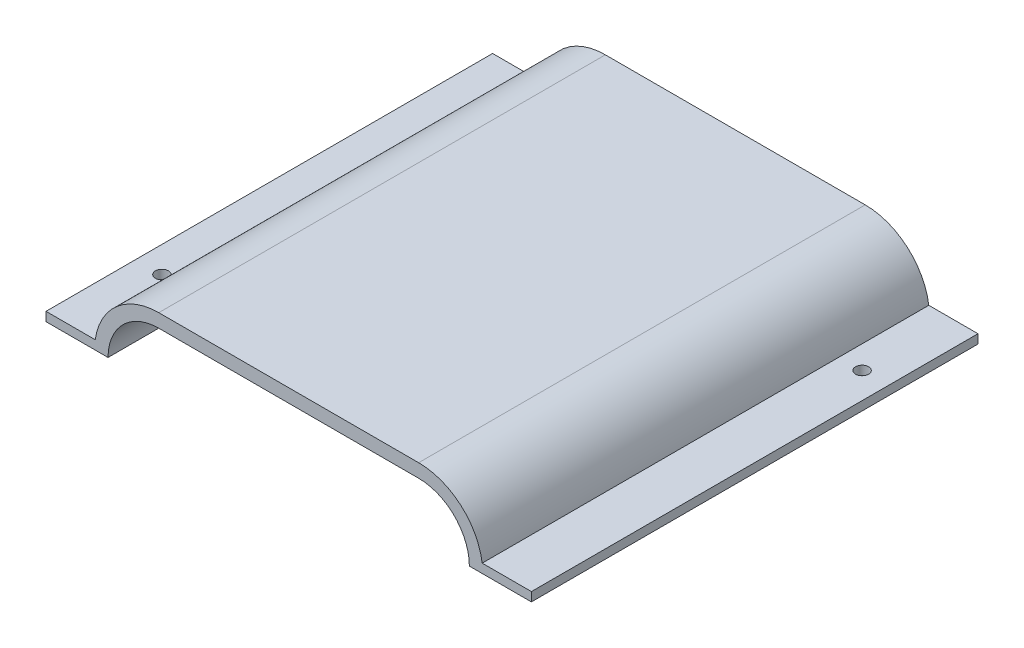
ISO-10303-21;
HEADER;
FILE_DESCRIPTION(('STEP AP214'),'2;1');
FILE_NAME('part.step','',(''),(''),'','','');
FILE_SCHEMA(('AUTOMOTIVE_DESIGN { 1 0 10303 214 1 1 1 1 }'));
ENDSEC;
DATA;
#1=APPLICATION_CONTEXT('core data for automotive mechanical design processes');
#2=APPLICATION_PROTOCOL_DEFINITION('international standard','automotive_design',2000,#1);
#3=PRODUCT_CONTEXT('',#1,'mechanical');
#4=PRODUCT('Part','Part','',(#3));
#5=PRODUCT_RELATED_PRODUCT_CATEGORY('part','',(#4));
#6=PRODUCT_DEFINITION_FORMATION('','',#4);
#7=PRODUCT_DEFINITION_CONTEXT('part definition',#1,'design');
#8=PRODUCT_DEFINITION('design','',#6,#7);
#9=PRODUCT_DEFINITION_SHAPE('','',#8);
#10=(LENGTH_UNIT() NAMED_UNIT(*) SI_UNIT(.MILLI.,.METRE.));
#11=(NAMED_UNIT(*) PLANE_ANGLE_UNIT() SI_UNIT($,.RADIAN.));
#12=(NAMED_UNIT(*) SI_UNIT($,.STERADIAN.) SOLID_ANGLE_UNIT());
#13=UNCERTAINTY_MEASURE_WITH_UNIT(LENGTH_MEASURE(1.E-05),#10,'distance_accuracy_value','');
#14=(GEOMETRIC_REPRESENTATION_CONTEXT(3) GLOBAL_UNCERTAINTY_ASSIGNED_CONTEXT((#13)) GLOBAL_UNIT_ASSIGNED_CONTEXT((#10,
#11,#12)) REPRESENTATION_CONTEXT('',''));
#15=CARTESIAN_POINT('',(0.,0.,0.));
#16=DIRECTION('',(0.,0.,1.));
#17=DIRECTION('',(1.,0.,0.));
#18=AXIS2_PLACEMENT_3D('',#15,#16,#17);
#19=CARTESIAN_POINT('',(0.,33.35,99.5));
#20=DIRECTION('',(0.,1.,0.));
#21=DIRECTION('',(0.,0.,1.));
#22=AXIS2_PLACEMENT_3D('',#19,#20,#21);
#23=PLANE('',#22);
#24=DIRECTION('',(1.,0.,0.));
#25=VECTOR('',#24,1.);
#26=CARTESIAN_POINT('',(0.,33.35,0.));
#27=LINE('',#26,#25);
#28=CARTESIAN_POINT('',(-28.95,33.35,0.));
#29=VERTEX_POINT('',#28);
#30=CARTESIAN_POINT('',(28.95,33.35,0.));
#31=VERTEX_POINT('',#30);
#32=EDGE_CURVE('E156',#29,#31,#27,.T.);
#33=ORIENTED_EDGE('',*,*,#32,.F.);
#34=DIRECTION('',(0.,0.,-1.));
#35=VECTOR('',#34,1.);
#36=CARTESIAN_POINT('',(-28.95,33.35,99.5));
#37=LINE('',#36,#35);
#38=CARTESIAN_POINT('',(-28.95,33.35,99.5));
#39=VERTEX_POINT('',#38);
#40=EDGE_CURVE('E11',#39,#29,#37,.T.);
#41=ORIENTED_EDGE('',*,*,#40,.F.);
#42=DIRECTION('',(1.,0.,0.));
#43=VECTOR('',#42,1.);
#44=CARTESIAN_POINT('',(0.,33.35,99.5));
#45=LINE('',#44,#43);
#46=CARTESIAN_POINT('',(28.95,33.35,99.5));
#47=VERTEX_POINT('',#46);
#48=EDGE_CURVE('E187',#39,#47,#45,.T.);
#49=ORIENTED_EDGE('',*,*,#48,.T.);
#50=DIRECTION('',(0.,0.,-1.));
#51=VECTOR('',#50,1.);
#52=CARTESIAN_POINT('',(28.95,33.35,99.5));
#53=LINE('',#52,#51);
#54=EDGE_CURVE('E101',#47,#31,#53,.T.);
#55=ORIENTED_EDGE('',*,*,#54,.T.);
#56=EDGE_LOOP('',(#33,#41,#49,#55));
#57=FACE_BOUND('',#56,.T.);
#58=ADVANCED_FACE('F38',(#57),#23,.T.);
#59=CARTESIAN_POINT('',(-28.95,19.05,99.5));
#60=DIRECTION('',(0.,0.,-1.));
#61=DIRECTION('',(-1.,0.,0.));
#62=AXIS2_PLACEMENT_3D('',#59,#60,#61);
#63=CYLINDRICAL_SURFACE('',#62,14.3);
#64=CARTESIAN_POINT('',(-28.95,19.05,0.));
#65=DIRECTION('',(0.,0.,1.));
#66=DIRECTION('',(1.,0.,0.));
#67=AXIS2_PLACEMENT_3D('',#64,#65,#66);
#68=CIRCLE('',#67,14.3);
#69=CARTESIAN_POINT('',(-43.1094491418275,21.05,0.));
#70=VERTEX_POINT('',#69);
#71=EDGE_CURVE('E159',#29,#70,#68,.T.);
#72=ORIENTED_EDGE('',*,*,#71,.T.);
#73=DIRECTION('',(0.,0.,-1.));
#74=VECTOR('',#73,1.);
#75=CARTESIAN_POINT('',(-43.1094491418275,21.05,99.5));
#76=LINE('',#75,#74);
#77=CARTESIAN_POINT('',(-43.1094491418275,21.05,99.5));
#78=VERTEX_POINT('',#77);
#79=EDGE_CURVE('E46',#78,#70,#76,.T.);
#80=ORIENTED_EDGE('',*,*,#79,.F.);
#81=CARTESIAN_POINT('',(-28.95,19.05,99.5));
#82=DIRECTION('',(0.,0.,1.));
#83=DIRECTION('',(1.,0.,0.));
#84=AXIS2_PLACEMENT_3D('',#81,#82,#83);
#85=CIRCLE('',#84,14.3);
#86=EDGE_CURVE('E222',#39,#78,#85,.T.);
#87=ORIENTED_EDGE('',*,*,#86,.F.);
#88=ORIENTED_EDGE('',*,*,#40,.T.);
#89=EDGE_LOOP('',(#72,#80,#87,#88));
#90=FACE_BOUND('',#89,.T.);
#91=ADVANCED_FACE('F211',(#90),#63,.T.);
#92=CARTESIAN_POINT('',(0.,21.05,99.5));
#93=DIRECTION('',(0.,1.,0.));
#94=DIRECTION('',(-1.,0.,0.));
#95=AXIS2_PLACEMENT_3D('',#92,#93,#94);
#96=PLANE('',#95);
#97=CARTESIAN_POINT('',(-48.25,21.05,79.5));
#98=DIRECTION('',(0.,1.,0.));
#99=DIRECTION('',(-1.,0.,0.));
#100=AXIS2_PLACEMENT_3D('',#97,#98,#99);
#101=CIRCLE('',#100,1.45);
#102=CARTESIAN_POINT('',(-49.7,21.05,79.5));
#103=VERTEX_POINT('',#102);
#104=EDGE_CURVE('E272',#103,#103,#101,.F.);
#105=ORIENTED_EDGE('',*,*,#104,.T.);
#106=EDGE_LOOP('',(#105));
#107=FACE_BOUND('',#106,.T.);
#108=DIRECTION('',(1.,0.,0.));
#109=VECTOR('',#108,1.);
#110=CARTESIAN_POINT('',(0.,21.05,0.));
#111=LINE('',#110,#109);
#112=CARTESIAN_POINT('',(-54.0716006042296,21.05,0.));
#113=VERTEX_POINT('',#112);
#114=EDGE_CURVE('E163',#113,#70,#111,.T.);
#115=ORIENTED_EDGE('',*,*,#114,.F.);
#116=DIRECTION('',(0.,0.,-1.));
#117=VECTOR('',#116,1.);
#118=CARTESIAN_POINT('',(-54.0716006042296,21.05,99.5));
#119=LINE('',#118,#117);
#120=CARTESIAN_POINT('',(-54.0716006042296,21.05,99.5));
#121=VERTEX_POINT('',#120);
#122=EDGE_CURVE('E201',#121,#113,#119,.T.);
#123=ORIENTED_EDGE('',*,*,#122,.F.);
#124=DIRECTION('',(1.,0.,0.));
#125=VECTOR('',#124,1.);
#126=CARTESIAN_POINT('',(0.,21.05,99.5));
#127=LINE('',#126,#125);
#128=EDGE_CURVE('E208',#121,#78,#127,.T.);
#129=ORIENTED_EDGE('',*,*,#128,.T.);
#130=ORIENTED_EDGE('',*,*,#79,.T.);
#131=EDGE_LOOP('',(#115,#123,#129,#130));
#132=FACE_BOUND('',#131,.T.);
#133=ADVANCED_FACE('F206',(#107,#132),#96,.T.);
#134=CARTESIAN_POINT('',(-54.0716006042296,0.,99.5));
#135=DIRECTION('',(-1.,0.,0.));
#136=DIRECTION('',(0.,0.,1.));
#137=AXIS2_PLACEMENT_3D('',#134,#135,#136);
#138=PLANE('',#137);
#139=DIRECTION('',(0.,1.,0.));
#140=VECTOR('',#139,1.);
#141=CARTESIAN_POINT('',(-54.0716006042296,0.,0.));
#142=LINE('',#141,#140);
#143=CARTESIAN_POINT('',(-54.0716006042296,19.05,0.));
#144=VERTEX_POINT('',#143);
#145=EDGE_CURVE('E166',#144,#113,#142,.T.);
#146=ORIENTED_EDGE('',*,*,#145,.F.);
#147=DIRECTION('',(0.,0.,-1.));
#148=VECTOR('',#147,1.);
#149=CARTESIAN_POINT('',(-54.0716006042296,19.05,99.5));
#150=LINE('',#149,#148);
#151=CARTESIAN_POINT('',(-54.0716006042296,19.05,99.5));
#152=VERTEX_POINT('',#151);
#153=EDGE_CURVE('E199',#152,#144,#150,.T.);
#154=ORIENTED_EDGE('',*,*,#153,.F.);
#155=DIRECTION('',(0.,1.,0.));
#156=VECTOR('',#155,1.);
#157=CARTESIAN_POINT('',(-54.0716006042296,0.,99.5));
#158=LINE('',#157,#156);
#159=EDGE_CURVE('E221',#152,#121,#158,.T.);
#160=ORIENTED_EDGE('',*,*,#159,.T.);
#161=ORIENTED_EDGE('',*,*,#122,.T.);
#162=EDGE_LOOP('',(#146,#154,#160,#161));
#163=FACE_BOUND('',#162,.T.);
#164=ADVANCED_FACE('F217',(#163),#138,.T.);
#165=CARTESIAN_POINT('',(0.,19.05,99.5));
#166=DIRECTION('',(0.,1.,0.));
#167=DIRECTION('',(0.,0.,1.));
#168=AXIS2_PLACEMENT_3D('',#165,#166,#167);
#169=PLANE('',#168);
#170=CARTESIAN_POINT('',(-48.25,19.05,79.5));
#171=DIRECTION('',(0.,-1.,0.));
#172=DIRECTION('',(0.,0.,-1.));
#173=AXIS2_PLACEMENT_3D('',#170,#171,#172);
#174=CIRCLE('',#173,1.45);
#175=CARTESIAN_POINT('',(-48.25,19.05,78.05));
#176=VERTEX_POINT('',#175);
#177=EDGE_CURVE('E268',#176,#176,#174,.T.);
#178=ORIENTED_EDGE('',*,*,#177,.F.);
#179=EDGE_LOOP('',(#178));
#180=FACE_BOUND('',#179,.T.);
#181=DIRECTION('',(1.,0.,0.));
#182=VECTOR('',#181,1.);
#183=CARTESIAN_POINT('',(0.,19.05,0.));
#184=LINE('',#183,#182);
#185=CARTESIAN_POINT('',(-40.25,19.05,0.));
#186=VERTEX_POINT('',#185);
#187=EDGE_CURVE('E169',#144,#186,#184,.T.);
#188=ORIENTED_EDGE('',*,*,#187,.T.);
#189=DIRECTION('',(0.,0.,-1.));
#190=VECTOR('',#189,1.);
#191=CARTESIAN_POINT('',(-40.25,19.05,99.5));
#192=LINE('',#191,#190);
#193=CARTESIAN_POINT('',(-40.25,19.05,99.5));
#194=VERTEX_POINT('',#193);
#195=EDGE_CURVE('E197',#194,#186,#192,.T.);
#196=ORIENTED_EDGE('',*,*,#195,.F.);
#197=DIRECTION('',(1.,0.,0.));
#198=VECTOR('',#197,1.);
#199=CARTESIAN_POINT('',(0.,19.05,99.5));
#200=LINE('',#199,#198);
#201=EDGE_CURVE('E224',#152,#194,#200,.T.);
#202=ORIENTED_EDGE('',*,*,#201,.F.);
#203=ORIENTED_EDGE('',*,*,#153,.T.);
#204=EDGE_LOOP('',(#188,#196,#202,#203));
#205=FACE_BOUND('',#204,.T.);
#206=ADVANCED_FACE('F310',(#180,#205),#169,.F.);
#207=CARTESIAN_POINT('',(-28.95,19.05,99.5));
#208=DIRECTION('',(0.,0.,-1.));
#209=DIRECTION('',(-1.,0.,0.));
#210=AXIS2_PLACEMENT_3D('',#207,#208,#209);
#211=CYLINDRICAL_SURFACE('',#210,11.3);
#212=CARTESIAN_POINT('',(-28.95,19.05,0.));
#213=DIRECTION('',(0.,0.,1.));
#214=DIRECTION('',(1.,0.,0.));
#215=AXIS2_PLACEMENT_3D('',#212,#213,#214);
#216=CIRCLE('',#215,11.3);
#217=CARTESIAN_POINT('',(-28.95,30.35,0.));
#218=VERTEX_POINT('',#217);
#219=EDGE_CURVE('E172',#218,#186,#216,.T.);
#220=ORIENTED_EDGE('',*,*,#219,.F.);
#221=DIRECTION('',(0.,0.,-1.));
#222=VECTOR('',#221,1.);
#223=CARTESIAN_POINT('',(-28.95,30.35,99.5));
#224=LINE('',#223,#222);
#225=CARTESIAN_POINT('',(-28.95,30.35,99.5));
#226=VERTEX_POINT('',#225);
#227=EDGE_CURVE('E195',#226,#218,#224,.T.);
#228=ORIENTED_EDGE('',*,*,#227,.F.);
#229=CARTESIAN_POINT('',(-28.95,19.05,99.5));
#230=DIRECTION('',(0.,0.,1.));
#231=DIRECTION('',(1.,0.,0.));
#232=AXIS2_PLACEMENT_3D('',#229,#230,#231);
#233=CIRCLE('',#232,11.3);
#234=EDGE_CURVE('E230',#226,#194,#233,.T.);
#235=ORIENTED_EDGE('',*,*,#234,.T.);
#236=ORIENTED_EDGE('',*,*,#195,.T.);
#237=EDGE_LOOP('',(#220,#228,#235,#236));
#238=FACE_BOUND('',#237,.T.);
#239=ADVANCED_FACE('F315',(#238),#211,.F.);
#240=CARTESIAN_POINT('',(0.,30.35,99.5));
#241=DIRECTION('',(0.,1.,0.));
#242=DIRECTION('',(0.,0.,1.));
#243=AXIS2_PLACEMENT_3D('',#240,#241,#242);
#244=PLANE('',#243);
#245=DIRECTION('',(1.,0.,0.));
#246=VECTOR('',#245,1.);
#247=CARTESIAN_POINT('',(0.,30.35,0.));
#248=LINE('',#247,#246);
#249=CARTESIAN_POINT('',(28.95,30.35,0.));
#250=VERTEX_POINT('',#249);
#251=EDGE_CURVE('E175',#218,#250,#248,.T.);
#252=ORIENTED_EDGE('',*,*,#251,.T.);
#253=DIRECTION('',(0.,0.,-1.));
#254=VECTOR('',#253,1.);
#255=CARTESIAN_POINT('',(28.95,30.35,99.5));
#256=LINE('',#255,#254);
#257=CARTESIAN_POINT('',(28.95,30.35,99.5));
#258=VERTEX_POINT('',#257);
#259=EDGE_CURVE('E193',#258,#250,#256,.T.);
#260=ORIENTED_EDGE('',*,*,#259,.F.);
#261=DIRECTION('',(1.,0.,0.));
#262=VECTOR('',#261,1.);
#263=CARTESIAN_POINT('',(0.,30.35,99.5));
#264=LINE('',#263,#262);
#265=EDGE_CURVE('E233',#226,#258,#264,.T.);
#266=ORIENTED_EDGE('',*,*,#265,.F.);
#267=ORIENTED_EDGE('',*,*,#227,.T.);
#268=EDGE_LOOP('',(#252,#260,#266,#267));
#269=FACE_BOUND('',#268,.T.);
#270=ADVANCED_FACE('F244',(#269),#244,.F.);
#271=CARTESIAN_POINT('',(28.95,19.05,99.5));
#272=DIRECTION('',(0.,0.,-1.));
#273=DIRECTION('',(-1.,0.,0.));
#274=AXIS2_PLACEMENT_3D('',#271,#272,#273);
#275=CYLINDRICAL_SURFACE('',#274,11.3);
#276=CARTESIAN_POINT('',(28.95,19.05,0.));
#277=DIRECTION('',(0.,0.,1.));
#278=DIRECTION('',(1.,0.,0.));
#279=AXIS2_PLACEMENT_3D('',#276,#277,#278);
#280=CIRCLE('',#279,11.3);
#281=CARTESIAN_POINT('',(40.25,19.05,0.));
#282=VERTEX_POINT('',#281);
#283=EDGE_CURVE('E178',#282,#250,#280,.T.);
#284=ORIENTED_EDGE('',*,*,#283,.F.);
#285=DIRECTION('',(0.,0.,-1.));
#286=VECTOR('',#285,1.);
#287=CARTESIAN_POINT('',(40.25,19.05,99.5));
#288=LINE('',#287,#286);
#289=CARTESIAN_POINT('',(40.25,19.05,99.5));
#290=VERTEX_POINT('',#289);
#291=EDGE_CURVE('E191',#290,#282,#288,.T.);
#292=ORIENTED_EDGE('',*,*,#291,.F.);
#293=CARTESIAN_POINT('',(28.95,19.05,99.5));
#294=DIRECTION('',(0.,0.,1.));
#295=DIRECTION('',(1.,0.,0.));
#296=AXIS2_PLACEMENT_3D('',#293,#294,#295);
#297=CIRCLE('',#296,11.3);
#298=EDGE_CURVE('E235',#290,#258,#297,.T.);
#299=ORIENTED_EDGE('',*,*,#298,.T.);
#300=ORIENTED_EDGE('',*,*,#259,.T.);
#301=EDGE_LOOP('',(#284,#292,#299,#300));
#302=FACE_BOUND('',#301,.T.);
#303=ADVANCED_FACE('F239',(#302),#275,.F.);
#304=CARTESIAN_POINT('',(0.,19.05,99.5));
#305=DIRECTION('',(0.,1.,0.));
#306=DIRECTION('',(0.,0.,1.));
#307=AXIS2_PLACEMENT_3D('',#304,#305,#306);
#308=PLANE('',#307);
#309=CARTESIAN_POINT('',(48.25,19.05,20.));
#310=DIRECTION('',(0.,-1.,0.));
#311=DIRECTION('',(0.,0.,-1.));
#312=AXIS2_PLACEMENT_3D('',#309,#310,#311);
#313=CIRCLE('',#312,1.45);
#314=CARTESIAN_POINT('',(48.25,19.05,18.55));
#315=VERTEX_POINT('',#314);
#316=EDGE_CURVE('E271',#315,#315,#313,.T.);
#317=ORIENTED_EDGE('',*,*,#316,.F.);
#318=EDGE_LOOP('',(#317));
#319=FACE_BOUND('',#318,.T.);
#320=DIRECTION('',(1.,0.,0.));
#321=VECTOR('',#320,1.);
#322=CARTESIAN_POINT('',(0.,19.05,0.));
#323=LINE('',#322,#321);
#324=CARTESIAN_POINT('',(54.0716006042296,19.05,0.));
#325=VERTEX_POINT('',#324);
#326=EDGE_CURVE('E181',#282,#325,#323,.T.);
#327=ORIENTED_EDGE('',*,*,#326,.T.);
#328=DIRECTION('',(0.,0.,-1.));
#329=VECTOR('',#328,1.);
#330=CARTESIAN_POINT('',(54.0716006042296,19.05,99.5));
#331=LINE('',#330,#329);
#332=CARTESIAN_POINT('',(54.0716006042296,19.05,99.5));
#333=VERTEX_POINT('',#332);
#334=EDGE_CURVE('E148',#333,#325,#331,.T.);
#335=ORIENTED_EDGE('',*,*,#334,.F.);
#336=DIRECTION('',(1.,0.,0.));
#337=VECTOR('',#336,1.);
#338=CARTESIAN_POINT('',(0.,19.05,99.5));
#339=LINE('',#338,#337);
#340=EDGE_CURVE('E139',#290,#333,#339,.T.);
#341=ORIENTED_EDGE('',*,*,#340,.F.);
#342=ORIENTED_EDGE('',*,*,#291,.T.);
#343=EDGE_LOOP('',(#327,#335,#341,#342));
#344=FACE_BOUND('',#343,.T.);
#345=ADVANCED_FACE('F249',(#319,#344),#308,.F.);
#346=CARTESIAN_POINT('',(54.0716006042296,0.,99.5));
#347=DIRECTION('',(-1.,0.,0.));
#348=DIRECTION('',(0.,0.,1.));
#349=AXIS2_PLACEMENT_3D('',#346,#347,#348);
#350=PLANE('',#349);
#351=DIRECTION('',(0.,1.,0.));
#352=VECTOR('',#351,1.);
#353=CARTESIAN_POINT('',(54.0716006042296,0.,0.));
#354=LINE('',#353,#352);
#355=CARTESIAN_POINT('',(54.0716006042296,21.05,0.));
#356=VERTEX_POINT('',#355);
#357=EDGE_CURVE('E147',#325,#356,#354,.T.);
#358=ORIENTED_EDGE('',*,*,#357,.T.);
#359=DIRECTION('',(0.,0.,-1.));
#360=VECTOR('',#359,1.);
#361=CARTESIAN_POINT('',(54.0716006042296,21.05,99.5));
#362=LINE('',#361,#360);
#363=CARTESIAN_POINT('',(54.0716006042296,21.05,99.5));
#364=VERTEX_POINT('',#363);
#365=EDGE_CURVE('E144',#364,#356,#362,.T.);
#366=ORIENTED_EDGE('',*,*,#365,.F.);
#367=DIRECTION('',(0.,1.,0.));
#368=VECTOR('',#367,1.);
#369=CARTESIAN_POINT('',(54.0716006042296,0.,99.5));
#370=LINE('',#369,#368);
#371=EDGE_CURVE('E132',#333,#364,#370,.T.);
#372=ORIENTED_EDGE('',*,*,#371,.F.);
#373=ORIENTED_EDGE('',*,*,#334,.T.);
#374=EDGE_LOOP('',(#358,#366,#372,#373));
#375=FACE_BOUND('',#374,.T.);
#376=ADVANCED_FACE('F145',(#375),#350,.F.);
#377=CARTESIAN_POINT('',(0.,21.05,99.5));
#378=DIRECTION('',(0.,-1.,0.));
#379=DIRECTION('',(1.,0.,0.));
#380=AXIS2_PLACEMENT_3D('',#377,#378,#379);
#381=PLANE('',#380);
#382=CARTESIAN_POINT('',(48.25,21.05,20.));
#383=DIRECTION('',(0.,1.,0.));
#384=DIRECTION('',(-1.,0.,0.));
#385=AXIS2_PLACEMENT_3D('',#382,#383,#384);
#386=CIRCLE('',#385,1.45);
#387=CARTESIAN_POINT('',(46.8,21.05,20.));
#388=VERTEX_POINT('',#387);
#389=EDGE_CURVE('E160',#388,#388,#386,.F.);
#390=ORIENTED_EDGE('',*,*,#389,.T.);
#391=EDGE_LOOP('',(#390));
#392=FACE_BOUND('',#391,.T.);
#393=DIRECTION('',(-1.,0.,0.));
#394=VECTOR('',#393,1.);
#395=CARTESIAN_POINT('',(0.,21.05,0.));
#396=LINE('',#395,#394);
#397=CARTESIAN_POINT('',(43.1094491418275,21.05,0.));
#398=VERTEX_POINT('',#397);
#399=EDGE_CURVE('E94',#356,#398,#396,.T.);
#400=ORIENTED_EDGE('',*,*,#399,.T.);
#401=DIRECTION('',(0.,0.,-1.));
#402=VECTOR('',#401,1.);
#403=CARTESIAN_POINT('',(43.1094491418275,21.05,99.5));
#404=LINE('',#403,#402);
#405=CARTESIAN_POINT('',(43.1094491418275,21.05,99.5));
#406=VERTEX_POINT('',#405);
#407=EDGE_CURVE('E149',#406,#398,#404,.T.);
#408=ORIENTED_EDGE('',*,*,#407,.F.);
#409=DIRECTION('',(-1.,0.,0.));
#410=VECTOR('',#409,1.);
#411=CARTESIAN_POINT('',(0.,21.05,99.5));
#412=LINE('',#411,#410);
#413=EDGE_CURVE('E136',#364,#406,#412,.T.);
#414=ORIENTED_EDGE('',*,*,#413,.F.);
#415=ORIENTED_EDGE('',*,*,#365,.T.);
#416=EDGE_LOOP('',(#400,#408,#414,#415));
#417=FACE_BOUND('',#416,.T.);
#418=ADVANCED_FACE('F151',(#392,#417),#381,.F.);
#419=CARTESIAN_POINT('',(28.95,19.05,99.5));
#420=DIRECTION('',(0.,0.,-1.));
#421=DIRECTION('',(-1.,0.,0.));
#422=AXIS2_PLACEMENT_3D('',#419,#420,#421);
#423=CYLINDRICAL_SURFACE('',#422,14.3);
#424=CARTESIAN_POINT('',(28.95,19.05,0.));
#425=DIRECTION('',(0.,0.,1.));
#426=DIRECTION('',(1.,0.,0.));
#427=AXIS2_PLACEMENT_3D('',#424,#425,#426);
#428=CIRCLE('',#427,14.3);
#429=EDGE_CURVE('E185',#398,#31,#428,.T.);
#430=ORIENTED_EDGE('',*,*,#429,.T.);
#431=ORIENTED_EDGE('',*,*,#54,.F.);
#432=CARTESIAN_POINT('',(28.95,19.05,99.5));
#433=DIRECTION('',(0.,0.,1.));
#434=DIRECTION('',(1.,0.,0.));
#435=AXIS2_PLACEMENT_3D('',#432,#433,#434);
#436=CIRCLE('',#435,14.3);
#437=EDGE_CURVE('E54',#406,#47,#436,.T.);
#438=ORIENTED_EDGE('',*,*,#437,.F.);
#439=ORIENTED_EDGE('',*,*,#407,.T.);
#440=EDGE_LOOP('',(#430,#431,#438,#439));
#441=FACE_BOUND('',#440,.T.);
#442=ADVANCED_FACE('F266',(#441),#423,.T.);
#443=CARTESIAN_POINT('',(0.,0.,99.5));
#444=DIRECTION('',(0.,0.,1.));
#445=DIRECTION('',(1.,0.,0.));
#446=AXIS2_PLACEMENT_3D('',#443,#444,#445);
#447=PLANE('',#446);
#448=ORIENTED_EDGE('',*,*,#48,.F.);
#449=ORIENTED_EDGE('',*,*,#86,.T.);
#450=ORIENTED_EDGE('',*,*,#128,.F.);
#451=ORIENTED_EDGE('',*,*,#159,.F.);
#452=ORIENTED_EDGE('',*,*,#201,.T.);
#453=ORIENTED_EDGE('',*,*,#234,.F.);
#454=ORIENTED_EDGE('',*,*,#265,.T.);
#455=ORIENTED_EDGE('',*,*,#298,.F.);
#456=ORIENTED_EDGE('',*,*,#340,.T.);
#457=ORIENTED_EDGE('',*,*,#371,.T.);
#458=ORIENTED_EDGE('',*,*,#413,.T.);
#459=ORIENTED_EDGE('',*,*,#437,.T.);
#460=EDGE_LOOP('',(#448,#449,#450,#451,#452,#453,#454,#455,#456,#457,#458,#459));
#461=FACE_BOUND('',#460,.T.);
#462=ADVANCED_FACE('F134',(#461),#447,.T.);
#463=CARTESIAN_POINT('',(0.,0.,0.));
#464=DIRECTION('',(0.,0.,1.));
#465=DIRECTION('',(1.,0.,0.));
#466=AXIS2_PLACEMENT_3D('',#463,#464,#465);
#467=PLANE('',#466);
#468=ORIENTED_EDGE('',*,*,#32,.T.);
#469=ORIENTED_EDGE('',*,*,#429,.F.);
#470=ORIENTED_EDGE('',*,*,#399,.F.);
#471=ORIENTED_EDGE('',*,*,#357,.F.);
#472=ORIENTED_EDGE('',*,*,#326,.F.);
#473=ORIENTED_EDGE('',*,*,#283,.T.);
#474=ORIENTED_EDGE('',*,*,#251,.F.);
#475=ORIENTED_EDGE('',*,*,#219,.T.);
#476=ORIENTED_EDGE('',*,*,#187,.F.);
#477=ORIENTED_EDGE('',*,*,#145,.T.);
#478=ORIENTED_EDGE('',*,*,#114,.T.);
#479=ORIENTED_EDGE('',*,*,#71,.F.);
#480=EDGE_LOOP('',(#468,#469,#470,#471,#472,#473,#474,#475,#476,#477,#478,#479));
#481=FACE_BOUND('',#480,.T.);
#482=ADVANCED_FACE('F213',(#481),#467,.F.);
#483=CARTESIAN_POINT('',(48.25,25.151219330882,20.));
#484=DIRECTION('',(0.,-1.,0.));
#485=DIRECTION('',(0.,0.,-1.));
#486=AXIS2_PLACEMENT_3D('',#483,#484,#485);
#487=CYLINDRICAL_SURFACE('',#486,1.45);
#488=ORIENTED_EDGE('',*,*,#316,.T.);
#489=EDGE_LOOP('',(#488));
#490=FACE_BOUND('',#489,.T.);
#491=ORIENTED_EDGE('',*,*,#389,.F.);
#492=EDGE_LOOP('',(#491));
#493=FACE_BOUND('',#492,.T.);
#494=ADVANCED_FACE('F279',(#490,#493),#487,.F.);
#495=CARTESIAN_POINT('',(-48.25,25.151219330882,79.5));
#496=DIRECTION('',(0.,-1.,0.));
#497=DIRECTION('',(0.,0.,-1.));
#498=AXIS2_PLACEMENT_3D('',#495,#496,#497);
#499=CYLINDRICAL_SURFACE('',#498,1.45);
#500=ORIENTED_EDGE('',*,*,#177,.T.);
#501=EDGE_LOOP('',(#500));
#502=FACE_BOUND('',#501,.T.);
#503=ORIENTED_EDGE('',*,*,#104,.F.);
#504=EDGE_LOOP('',(#503));
#505=FACE_BOUND('',#504,.T.);
#506=ADVANCED_FACE('F282',(#502,#505),#499,.F.);
#507=CLOSED_SHELL('',(#58,#91,#133,#164,#206,#239,#270,#303,#345,#376,#418,#442,#462,#482,#494,#506));
#508=MANIFOLD_SOLID_BREP('B2',#507);
#509=ADVANCED_BREP_SHAPE_REPRESENTATION('',(#18,#508),#14);
#510=SHAPE_DEFINITION_REPRESENTATION(#9,#509);
ENDSEC;
END-ISO-10303-21;
